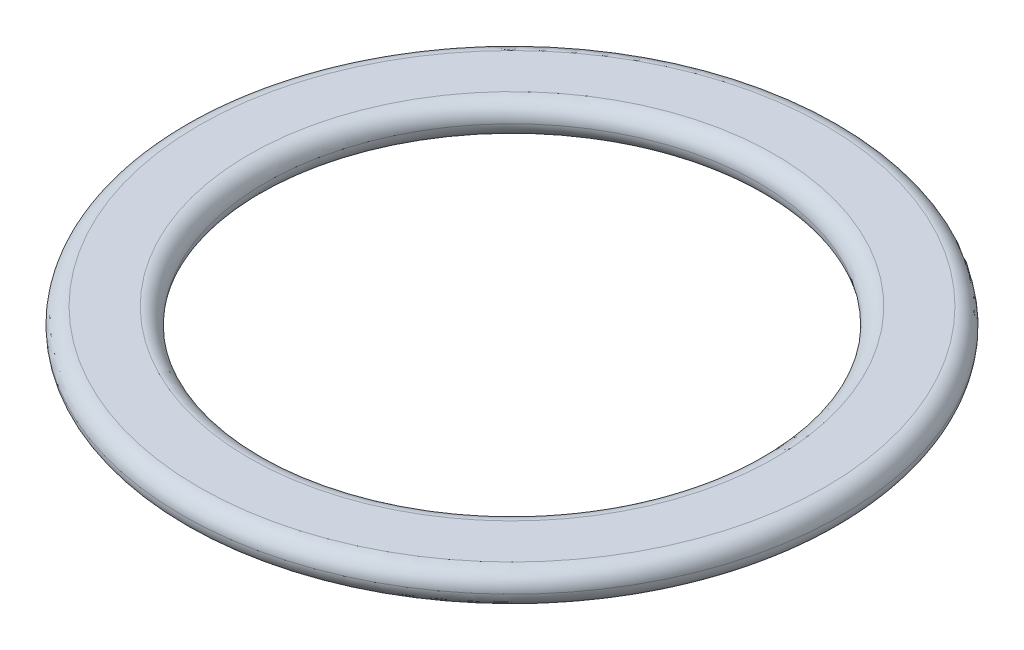
ISO-10303-21;
HEADER;
FILE_DESCRIPTION(('STEP AP214'),'2;1');
FILE_NAME('part.step','',(''),(''),'','','');
FILE_SCHEMA(('AUTOMOTIVE_DESIGN { 1 0 10303 214 1 1 1 1 }'));
ENDSEC;
DATA;
#1=APPLICATION_CONTEXT('core data for automotive mechanical design processes');
#2=APPLICATION_PROTOCOL_DEFINITION('international standard','automotive_design',2000,#1);
#3=PRODUCT_CONTEXT('',#1,'mechanical');
#4=PRODUCT('Part','Part','',(#3));
#5=PRODUCT_RELATED_PRODUCT_CATEGORY('part','',(#4));
#6=PRODUCT_DEFINITION_FORMATION('','',#4);
#7=PRODUCT_DEFINITION_CONTEXT('part definition',#1,'design');
#8=PRODUCT_DEFINITION('design','',#6,#7);
#9=PRODUCT_DEFINITION_SHAPE('','',#8);
#10=(LENGTH_UNIT() NAMED_UNIT(*) SI_UNIT(.MILLI.,.METRE.));
#11=(NAMED_UNIT(*) PLANE_ANGLE_UNIT() SI_UNIT($,.RADIAN.));
#12=(NAMED_UNIT(*) SI_UNIT($,.STERADIAN.) SOLID_ANGLE_UNIT());
#13=UNCERTAINTY_MEASURE_WITH_UNIT(LENGTH_MEASURE(1.E-05),#10,'distance_accuracy_value','');
#14=(GEOMETRIC_REPRESENTATION_CONTEXT(3) GLOBAL_UNCERTAINTY_ASSIGNED_CONTEXT((#13)) GLOBAL_UNIT_ASSIGNED_CONTEXT((#10,
#11,#12)) REPRESENTATION_CONTEXT('',''));
#15=CARTESIAN_POINT('',(0.,0.,0.));
#16=DIRECTION('',(0.,0.,1.));
#17=DIRECTION('',(1.,0.,0.));
#18=AXIS2_PLACEMENT_3D('',#15,#16,#17);
#19=CARTESIAN_POINT('',(0.,1.21,0.));
#20=DIRECTION('',(0.,1.,0.));
#21=DIRECTION('',(0.,0.,1.));
#22=AXIS2_PLACEMENT_3D('',#19,#20,#21);
#23=PLANE('',#22);
#24=CARTESIAN_POINT('',(0.,1.21,0.));
#25=DIRECTION('',(0.,1.,0.));
#26=DIRECTION('',(0.,0.,1.));
#27=AXIS2_PLACEMENT_3D('',#24,#25,#26);
#28=CIRCLE('',#27,9.82);
#29=CARTESIAN_POINT('',(0.,1.21,9.82));
#30=VERTEX_POINT('',#29);
#31=EDGE_CURVE('E37',#30,#30,#28,.F.);
#32=ORIENTED_EDGE('',*,*,#31,.T.);
#33=EDGE_LOOP('',(#32));
#34=FACE_BOUND('',#33,.T.);
#35=CARTESIAN_POINT('',(0.,1.21,0.));
#36=DIRECTION('',(0.,1.,0.));
#37=DIRECTION('',(0.,0.,1.));
#38=AXIS2_PLACEMENT_3D('',#35,#36,#37);
#39=CIRCLE('',#38,11.7);
#40=CARTESIAN_POINT('',(0.,1.21,11.7));
#41=VERTEX_POINT('',#40);
#42=EDGE_CURVE('E53',#41,#41,#39,.T.);
#43=ORIENTED_EDGE('',*,*,#42,.T.);
#44=EDGE_LOOP('',(#43));
#45=FACE_BOUND('',#44,.T.);
#46=ADVANCED_FACE('F30',(#34,#45),#23,.T.);
#47=CARTESIAN_POINT('',(0.,0.,0.));
#48=DIRECTION('',(0.,1.,0.));
#49=DIRECTION('',(0.,0.,1.));
#50=AXIS2_PLACEMENT_3D('',#47,#48,#49);
#51=PLANE('',#50);
#52=CARTESIAN_POINT('',(0.,0.,0.));
#53=DIRECTION('',(0.,1.,0.));
#54=DIRECTION('',(0.,0.,1.));
#55=AXIS2_PLACEMENT_3D('',#52,#53,#54);
#56=CIRCLE('',#55,9.81991802727908);
#57=CARTESIAN_POINT('',(0.,0.,9.81991802727908));
#58=VERTEX_POINT('',#57);
#59=EDGE_CURVE('E10',#58,#58,#56,.T.);
#60=ORIENTED_EDGE('',*,*,#59,.T.);
#61=EDGE_LOOP('',(#60));
#62=FACE_BOUND('',#61,.T.);
#63=CARTESIAN_POINT('',(0.,0.,0.));
#64=DIRECTION('',(0.,1.,0.));
#65=DIRECTION('',(0.,0.,1.));
#66=AXIS2_PLACEMENT_3D('',#63,#64,#65);
#67=CIRCLE('',#66,11.7000819727209);
#68=CARTESIAN_POINT('',(0.,0.,11.7000819727209));
#69=VERTEX_POINT('',#68);
#70=EDGE_CURVE('E45',#69,#69,#67,.F.);
#71=ORIENTED_EDGE('',*,*,#70,.T.);
#72=EDGE_LOOP('',(#71));
#73=FACE_BOUND('',#72,.T.);
#74=ADVANCED_FACE('F61',(#62,#73),#51,.F.);
#75=CARTESIAN_POINT('',(0.,0.6,0.));
#76=DIRECTION('',(0.,1.,0.));
#77=DIRECTION('',(0.,0.,1.));
#78=AXIS2_PLACEMENT_3D('',#75,#76,#77);
#79=TOROIDAL_SURFACE('',#78,11.7,0.61);
#80=CARTESIAN_POINT('',(0.,0.6,0.));
#81=DIRECTION('',(0.,1.,0.));
#82=DIRECTION('',(0.,0.,1.));
#83=AXIS2_PLACEMENT_3D('',#80,#81,#82);
#84=CIRCLE('',#83,12.31);
#85=CARTESIAN_POINT('',(0.,0.6,12.31));
#86=VERTEX_POINT('',#85);
#87=EDGE_CURVE('E50',#86,#86,#84,.F.);
#88=ORIENTED_EDGE('',*,*,#87,.F.);
#89=EDGE_LOOP('',(#88));
#90=FACE_BOUND('',#89,.T.);
#91=ORIENTED_EDGE('',*,*,#42,.F.);
#92=EDGE_LOOP('',(#91));
#93=FACE_BOUND('',#92,.T.);
#94=ADVANCED_FACE('F58',(#90,#93),#79,.T.);
#95=CARTESIAN_POINT('',(0.,0.61,0.));
#96=DIRECTION('',(0.,-1.,0.));
#97=DIRECTION('',(0.,0.,-1.));
#98=AXIS2_PLACEMENT_3D('',#95,#96,#97);
#99=TOROIDAL_SURFACE('',#98,11.7000819727209,0.61);
#100=ORIENTED_EDGE('',*,*,#70,.F.);
#101=EDGE_LOOP('',(#100));
#102=FACE_BOUND('',#101,.T.);
#103=ORIENTED_EDGE('',*,*,#87,.T.);
#104=EDGE_LOOP('',(#103));
#105=FACE_BOUND('',#104,.T.);
#106=ADVANCED_FACE('F60',(#102,#105),#99,.T.);
#107=CARTESIAN_POINT('',(0.,0.6,0.));
#108=DIRECTION('',(0.,1.,0.));
#109=DIRECTION('',(0.,0.,1.));
#110=AXIS2_PLACEMENT_3D('',#107,#108,#109);
#111=TOROIDAL_SURFACE('',#110,9.82,0.61);
#112=ORIENTED_EDGE('',*,*,#31,.F.);
#113=EDGE_LOOP('',(#112));
#114=FACE_BOUND('',#113,.T.);
#115=CARTESIAN_POINT('',(0.,0.6,0.));
#116=DIRECTION('',(0.,1.,0.));
#117=DIRECTION('',(0.,0.,1.));
#118=AXIS2_PLACEMENT_3D('',#115,#116,#117);
#119=CIRCLE('',#118,9.21);
#120=CARTESIAN_POINT('',(0.,0.6,9.21));
#121=VERTEX_POINT('',#120);
#122=EDGE_CURVE('E41',#121,#121,#119,.T.);
#123=ORIENTED_EDGE('',*,*,#122,.F.);
#124=EDGE_LOOP('',(#123));
#125=FACE_BOUND('',#124,.T.);
#126=ADVANCED_FACE('F68',(#114,#125),#111,.T.);
#127=CARTESIAN_POINT('',(0.,0.61,0.));
#128=DIRECTION('',(0.,1.,0.));
#129=DIRECTION('',(0.,0.,1.));
#130=AXIS2_PLACEMENT_3D('',#127,#128,#129);
#131=TOROIDAL_SURFACE('',#130,9.81991802727908,0.61);
#132=ORIENTED_EDGE('',*,*,#122,.T.);
#133=EDGE_LOOP('',(#132));
#134=FACE_BOUND('',#133,.T.);
#135=ORIENTED_EDGE('',*,*,#59,.F.);
#136=EDGE_LOOP('',(#135));
#137=FACE_BOUND('',#136,.T.);
#138=ADVANCED_FACE('F32',(#134,#137),#131,.T.);
#139=CLOSED_SHELL('',(#46,#74,#94,#106,#126,#138));
#140=MANIFOLD_SOLID_BREP('B2',#139);
#141=ADVANCED_BREP_SHAPE_REPRESENTATION('',(#18,#140),#14);
#142=SHAPE_DEFINITION_REPRESENTATION(#9,#141);
ENDSEC;
END-ISO-10303-21;
